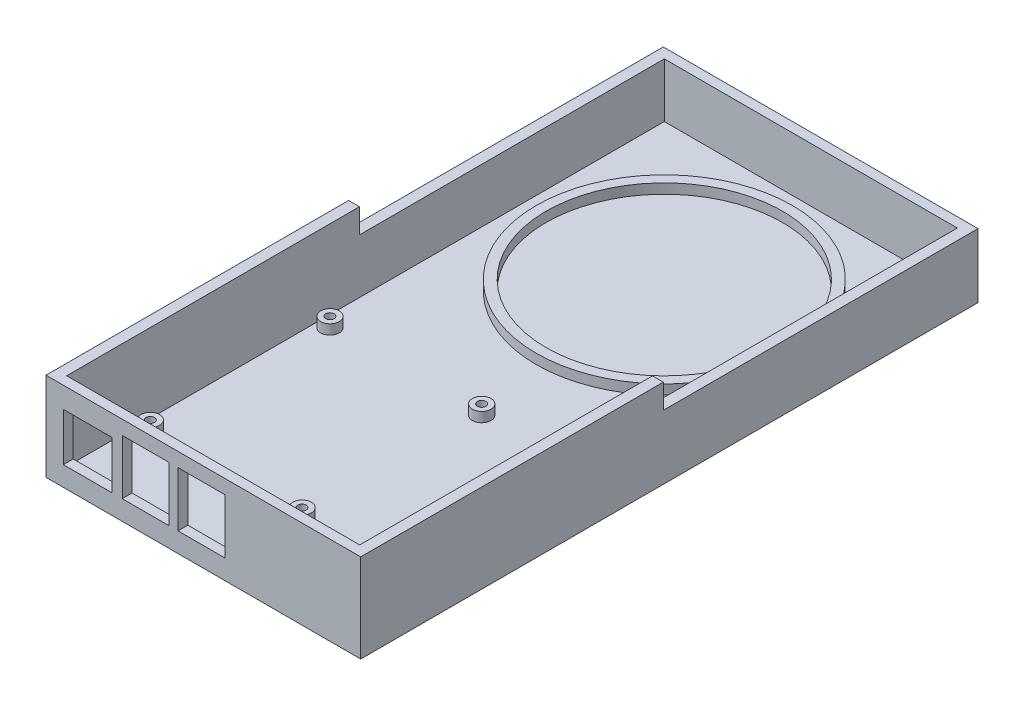
ISO-10303-21;
HEADER;
FILE_DESCRIPTION(('STEP AP214'),'2;1');
FILE_NAME('part.step','',(''),(''),'','','');
FILE_SCHEMA(('AUTOMOTIVE_DESIGN { 1 0 10303 214 1 1 1 1 }'));
ENDSEC;
DATA;
#1=APPLICATION_CONTEXT('core data for automotive mechanical design processes');
#2=APPLICATION_PROTOCOL_DEFINITION('international standard','automotive_design',2000,#1);
#3=PRODUCT_CONTEXT('',#1,'mechanical');
#4=PRODUCT('Part','Part','',(#3));
#5=PRODUCT_RELATED_PRODUCT_CATEGORY('part','',(#4));
#6=PRODUCT_DEFINITION_FORMATION('','',#4);
#7=PRODUCT_DEFINITION_CONTEXT('part definition',#1,'design');
#8=PRODUCT_DEFINITION('design','',#6,#7);
#9=PRODUCT_DEFINITION_SHAPE('','',#8);
#10=(LENGTH_UNIT() NAMED_UNIT(*) SI_UNIT(.MILLI.,.METRE.));
#11=(NAMED_UNIT(*) PLANE_ANGLE_UNIT() SI_UNIT($,.RADIAN.));
#12=(NAMED_UNIT(*) SI_UNIT($,.STERADIAN.) SOLID_ANGLE_UNIT());
#13=UNCERTAINTY_MEASURE_WITH_UNIT(LENGTH_MEASURE(1.E-05),#10,'distance_accuracy_value','');
#14=(GEOMETRIC_REPRESENTATION_CONTEXT(3) GLOBAL_UNCERTAINTY_ASSIGNED_CONTEXT((#13)) GLOBAL_UNIT_ASSIGNED_CONTEXT((#10,
#11,#12)) REPRESENTATION_CONTEXT('',''));
#15=CARTESIAN_POINT('',(0.,0.,0.));
#16=DIRECTION('',(0.,0.,1.));
#17=DIRECTION('',(1.,0.,0.));
#18=AXIS2_PLACEMENT_3D('',#15,#16,#17);
#19=CARTESIAN_POINT('',(0.,0.,0.));
#20=DIRECTION('',(0.,0.,-1.));
#21=DIRECTION('',(-1.,0.,0.));
#22=AXIS2_PLACEMENT_3D('',#19,#20,#21);
#23=PLANE('',#22);
#24=DIRECTION('',(0.,-1.,0.));
#25=VECTOR('',#24,1.);
#26=CARTESIAN_POINT('',(0.,0.,0.));
#27=LINE('',#26,#25);
#28=CARTESIAN_POINT('',(0.,20.701,0.));
#29=VERTEX_POINT('',#28);
#30=CARTESIAN_POINT('',(0.,0.,0.));
#31=VERTEX_POINT('',#30);
#32=EDGE_CURVE('E409',#29,#31,#27,.T.);
#33=ORIENTED_EDGE('',*,*,#32,.F.);
#34=DIRECTION('',(-1.,0.,0.));
#35=VECTOR('',#34,1.);
#36=CARTESIAN_POINT('',(0.,20.701,0.));
#37=LINE('',#36,#35);
#38=CARTESIAN_POINT('',(101.6,20.701,0.));
#39=VERTEX_POINT('',#38);
#40=EDGE_CURVE('E215',#39,#29,#37,.T.);
#41=ORIENTED_EDGE('',*,*,#40,.F.);
#42=DIRECTION('',(0.,1.,0.));
#43=VECTOR('',#42,1.);
#44=CARTESIAN_POINT('',(101.6,0.,0.));
#45=LINE('',#44,#43);
#46=CARTESIAN_POINT('',(101.6,0.,0.));
#47=VERTEX_POINT('',#46);
#48=EDGE_CURVE('E414',#47,#39,#45,.T.);
#49=ORIENTED_EDGE('',*,*,#48,.F.);
#50=DIRECTION('',(1.,0.,0.));
#51=VECTOR('',#50,1.);
#52=CARTESIAN_POINT('',(0.,0.,0.));
#53=LINE('',#52,#51);
#54=EDGE_CURVE('E420',#31,#47,#53,.T.);
#55=ORIENTED_EDGE('',*,*,#54,.F.);
#56=EDGE_LOOP('',(#33,#41,#49,#55));
#57=FACE_BOUND('',#56,.T.);
#58=ADVANCED_FACE('F41',(#57),#23,.T.);
#59=CARTESIAN_POINT('',(3.50000000000002,28.575,3.175));
#60=DIRECTION('',(0.,0.,1.));
#61=DIRECTION('',(1.,0.,0.));
#62=AXIS2_PLACEMENT_3D('',#59,#60,#61);
#63=PLANE('',#62);
#64=DIRECTION('',(0.,-1.,0.));
#65=VECTOR('',#64,1.);
#66=CARTESIAN_POINT('',(98.1,28.575,3.17499999999999));
#67=LINE('',#66,#65);
#68=CARTESIAN_POINT('',(98.1,20.701,3.17499999999999));
#69=VERTEX_POINT('',#68);
#70=CARTESIAN_POINT('',(98.1,3.175,3.17499999999999));
#71=VERTEX_POINT('',#70);
#72=EDGE_CURVE('E395',#69,#71,#67,.T.);
#73=ORIENTED_EDGE('',*,*,#72,.F.);
#74=DIRECTION('',(-1.,0.,0.));
#75=VECTOR('',#74,1.);
#76=CARTESIAN_POINT('',(3.50000000000002,20.701,3.175));
#77=LINE('',#76,#75);
#78=CARTESIAN_POINT('',(3.50000000000002,20.701,3.175));
#79=VERTEX_POINT('',#78);
#80=EDGE_CURVE('E49',#69,#79,#77,.T.);
#81=ORIENTED_EDGE('',*,*,#80,.T.);
#82=DIRECTION('',(0.,-1.,0.));
#83=VECTOR('',#82,1.);
#84=CARTESIAN_POINT('',(3.50000000000002,28.575,3.175));
#85=LINE('',#84,#83);
#86=CARTESIAN_POINT('',(3.50000000000002,3.175,3.17500000000001));
#87=VERTEX_POINT('',#86);
#88=EDGE_CURVE('E383',#79,#87,#85,.T.);
#89=ORIENTED_EDGE('',*,*,#88,.T.);
#90=DIRECTION('',(-1.,0.,0.));
#91=VECTOR('',#90,1.);
#92=CARTESIAN_POINT('',(3.50000000000002,3.175,3.175));
#93=LINE('',#92,#91);
#94=EDGE_CURVE('E378',#71,#87,#93,.T.);
#95=ORIENTED_EDGE('',*,*,#94,.F.);
#96=EDGE_LOOP('',(#73,#81,#89,#95));
#97=FACE_BOUND('',#96,.T.);
#98=ADVANCED_FACE('F446',(#97),#63,.T.);
#99=CARTESIAN_POINT('',(0.,0.,199.3));
#100=DIRECTION('',(1.,0.,0.));
#101=DIRECTION('',(0.,0.,-1.));
#102=AXIS2_PLACEMENT_3D('',#99,#100,#101);
#103=PLANE('',#102);
#104=DIRECTION('',(0.,0.,1.));
#105=VECTOR('',#104,1.);
#106=CARTESIAN_POINT('',(0.,28.575,0.));
#107=LINE('',#106,#105);
#108=CARTESIAN_POINT('',(0.,28.575,101.6));
#109=VERTEX_POINT('',#108);
#110=CARTESIAN_POINT('',(0.,28.575,199.3));
#111=VERTEX_POINT('',#110);
#112=EDGE_CURVE('E222',#109,#111,#107,.T.);
#113=ORIENTED_EDGE('',*,*,#112,.F.);
#114=DIRECTION('',(0.,1.,0.));
#115=VECTOR('',#114,1.);
#116=CARTESIAN_POINT('',(0.,20.701,101.6));
#117=LINE('',#116,#115);
#118=CARTESIAN_POINT('',(0.,20.701,101.6));
#119=VERTEX_POINT('',#118);
#120=EDGE_CURVE('E204',#119,#109,#117,.T.);
#121=ORIENTED_EDGE('',*,*,#120,.F.);
#122=DIRECTION('',(0.,0.,1.));
#123=VECTOR('',#122,1.);
#124=CARTESIAN_POINT('',(0.,20.701,0.));
#125=LINE('',#124,#123);
#126=EDGE_CURVE('E212',#29,#119,#125,.T.);
#127=ORIENTED_EDGE('',*,*,#126,.F.);
#128=ORIENTED_EDGE('',*,*,#32,.T.);
#129=DIRECTION('',(0.,0.,-1.));
#130=VECTOR('',#129,1.);
#131=CARTESIAN_POINT('',(0.,0.,199.3));
#132=LINE('',#131,#130);
#133=CARTESIAN_POINT('',(0.,0.,199.3));
#134=VERTEX_POINT('',#133);
#135=EDGE_CURVE('E426',#134,#31,#132,.T.);
#136=ORIENTED_EDGE('',*,*,#135,.F.);
#137=DIRECTION('',(0.,-1.,0.));
#138=VECTOR('',#137,1.);
#139=CARTESIAN_POINT('',(0.,0.,199.3));
#140=LINE('',#139,#138);
#141=EDGE_CURVE('E410',#111,#134,#140,.T.);
#142=ORIENTED_EDGE('',*,*,#141,.F.);
#143=EDGE_LOOP('',(#113,#121,#127,#128,#136,#142));
#144=FACE_BOUND('',#143,.T.);
#145=ADVANCED_FACE('F43',(#144),#103,.F.);
#146=CARTESIAN_POINT('',(0.,0.,199.3));
#147=DIRECTION('',(0.,1.,0.));
#148=DIRECTION('',(0.,0.,1.));
#149=AXIS2_PLACEMENT_3D('',#146,#147,#148);
#150=PLANE('',#149);
#151=CARTESIAN_POINT('',(7.127,0.,172.752));
#152=DIRECTION('',(0.,1.,0.));
#153=DIRECTION('',(0.,0.,1.));
#154=AXIS2_PLACEMENT_3D('',#151,#152,#153);
#155=CIRCLE('',#154,1.37499999999999);
#156=CARTESIAN_POINT('',(7.127,0.,174.127));
#157=VERTEX_POINT('',#156);
#158=EDGE_CURVE('E235',#157,#157,#155,.T.);
#159=ORIENTED_EDGE('',*,*,#158,.T.);
#160=EDGE_LOOP('',(#159));
#161=FACE_BOUND('',#160,.T.);
#162=CARTESIAN_POINT('',(56.127,0.,172.752));
#163=DIRECTION('',(0.,1.,0.));
#164=DIRECTION('',(0.,0.,1.));
#165=AXIS2_PLACEMENT_3D('',#162,#163,#164);
#166=CIRCLE('',#165,1.37500000000001);
#167=CARTESIAN_POINT('',(56.127,0.,174.127));
#168=VERTEX_POINT('',#167);
#169=EDGE_CURVE('E240',#168,#168,#166,.T.);
#170=ORIENTED_EDGE('',*,*,#169,.T.);
#171=EDGE_LOOP('',(#170));
#172=FACE_BOUND('',#171,.T.);
#173=CARTESIAN_POINT('',(56.127,0.,114.752));
#174=DIRECTION('',(0.,1.,0.));
#175=DIRECTION('',(0.,0.,1.));
#176=AXIS2_PLACEMENT_3D('',#173,#174,#175);
#177=CIRCLE('',#176,1.375);
#178=CARTESIAN_POINT('',(56.127,0.,116.127));
#179=VERTEX_POINT('',#178);
#180=EDGE_CURVE('E236',#179,#179,#177,.T.);
#181=ORIENTED_EDGE('',*,*,#180,.T.);
#182=EDGE_LOOP('',(#181));
#183=FACE_BOUND('',#182,.T.);
#184=CARTESIAN_POINT('',(7.12700000000002,0.,114.752));
#185=DIRECTION('',(0.,1.,0.));
#186=DIRECTION('',(0.,0.,1.));
#187=AXIS2_PLACEMENT_3D('',#184,#185,#186);
#188=CIRCLE('',#187,1.375);
#189=CARTESIAN_POINT('',(7.12700000000002,0.,116.127));
#190=VERTEX_POINT('',#189);
#191=EDGE_CURVE('E239',#190,#190,#188,.T.);
#192=ORIENTED_EDGE('',*,*,#191,.T.);
#193=EDGE_LOOP('',(#192));
#194=FACE_BOUND('',#193,.T.);
#195=ORIENTED_EDGE('',*,*,#54,.T.);
#196=DIRECTION('',(0.,0.,-1.));
#197=VECTOR('',#196,1.);
#198=CARTESIAN_POINT('',(101.6,0.,199.3));
#199=LINE('',#198,#197);
#200=CARTESIAN_POINT('',(101.6,0.,199.3));
#201=VERTEX_POINT('',#200);
#202=EDGE_CURVE('E418',#201,#47,#199,.T.);
#203=ORIENTED_EDGE('',*,*,#202,.F.);
#204=DIRECTION('',(1.,0.,0.));
#205=VECTOR('',#204,1.);
#206=CARTESIAN_POINT('',(0.,0.,199.3));
#207=LINE('',#206,#205);
#208=EDGE_CURVE('E413',#134,#201,#207,.T.);
#209=ORIENTED_EDGE('',*,*,#208,.F.);
#210=ORIENTED_EDGE('',*,*,#135,.T.);
#211=EDGE_LOOP('',(#195,#203,#209,#210));
#212=FACE_BOUND('',#211,.T.);
#213=ADVANCED_FACE('F483',(#161,#172,#183,#194,#212),#150,.F.);
#214=CARTESIAN_POINT('',(101.6,0.,199.3));
#215=DIRECTION('',(-1.,0.,0.));
#216=DIRECTION('',(0.,0.,1.));
#217=AXIS2_PLACEMENT_3D('',#214,#215,#216);
#218=PLANE('',#217);
#219=DIRECTION('',(0.,0.,-1.));
#220=VECTOR('',#219,1.);
#221=CARTESIAN_POINT('',(101.6,20.701,0.));
#222=LINE('',#221,#220);
#223=CARTESIAN_POINT('',(101.6,20.701,101.6));
#224=VERTEX_POINT('',#223);
#225=EDGE_CURVE('E208',#224,#39,#222,.T.);
#226=ORIENTED_EDGE('',*,*,#225,.F.);
#227=DIRECTION('',(0.,1.,0.));
#228=VECTOR('',#227,1.);
#229=CARTESIAN_POINT('',(101.6,20.701,101.6));
#230=LINE('',#229,#228);
#231=CARTESIAN_POINT('',(101.6,28.575,101.6));
#232=VERTEX_POINT('',#231);
#233=EDGE_CURVE('E223',#224,#232,#230,.T.);
#234=ORIENTED_EDGE('',*,*,#233,.T.);
#235=DIRECTION('',(0.,0.,-1.));
#236=VECTOR('',#235,1.);
#237=CARTESIAN_POINT('',(101.6,28.575,0.));
#238=LINE('',#237,#236);
#239=CARTESIAN_POINT('',(101.6,28.575,199.3));
#240=VERTEX_POINT('',#239);
#241=EDGE_CURVE('E406',#240,#232,#238,.T.);
#242=ORIENTED_EDGE('',*,*,#241,.F.);
#243=DIRECTION('',(0.,1.,0.));
#244=VECTOR('',#243,1.);
#245=CARTESIAN_POINT('',(101.6,0.,199.3));
#246=LINE('',#245,#244);
#247=EDGE_CURVE('E416',#201,#240,#246,.T.);
#248=ORIENTED_EDGE('',*,*,#247,.F.);
#249=ORIENTED_EDGE('',*,*,#202,.T.);
#250=ORIENTED_EDGE('',*,*,#48,.T.);
#251=EDGE_LOOP('',(#226,#234,#242,#248,#249,#250));
#252=FACE_BOUND('',#251,.T.);
#253=ADVANCED_FACE('F471',(#252),#218,.F.);
#254=CARTESIAN_POINT('',(0.,0.,199.3));
#255=DIRECTION('',(0.,0.,-1.));
#256=DIRECTION('',(-1.,0.,0.));
#257=AXIS2_PLACEMENT_3D('',#254,#255,#256);
#258=PLANE('',#257);
#259=DIRECTION('',(1.,0.,0.));
#260=VECTOR('',#259,1.);
#261=CARTESIAN_POINT('',(5.58275000000003,6.35,199.3));
#262=LINE('',#261,#260);
#263=CARTESIAN_POINT('',(5.58275000000003,6.35,199.3));
#264=VERTEX_POINT('',#263);
#265=CARTESIAN_POINT('',(21.26725,6.35,199.3));
#266=VERTEX_POINT('',#265);
#267=EDGE_CURVE('E263',#264,#266,#262,.T.);
#268=ORIENTED_EDGE('',*,*,#267,.F.);
#269=DIRECTION('',(0.,-1.,0.));
#270=VECTOR('',#269,1.);
#271=CARTESIAN_POINT('',(5.58275000000003,21.8186,199.3));
#272=LINE('',#271,#270);
#273=CARTESIAN_POINT('',(5.58275000000003,21.8186,199.3));
#274=VERTEX_POINT('',#273);
#275=EDGE_CURVE('E64',#274,#264,#272,.T.);
#276=ORIENTED_EDGE('',*,*,#275,.F.);
#277=DIRECTION('',(-1.,0.,0.));
#278=VECTOR('',#277,1.);
#279=CARTESIAN_POINT('',(5.58275000000003,21.8186,199.3));
#280=LINE('',#279,#278);
#281=CARTESIAN_POINT('',(21.26725,21.8186,199.3));
#282=VERTEX_POINT('',#281);
#283=EDGE_CURVE('E252',#282,#274,#280,.T.);
#284=ORIENTED_EDGE('',*,*,#283,.F.);
#285=DIRECTION('',(0.,1.,0.));
#286=VECTOR('',#285,1.);
#287=CARTESIAN_POINT('',(21.26725,21.8186,199.3));
#288=LINE('',#287,#286);
#289=EDGE_CURVE('E267',#266,#282,#288,.T.);
#290=ORIENTED_EDGE('',*,*,#289,.F.);
#291=EDGE_LOOP('',(#268,#276,#284,#290));
#292=FACE_BOUND('',#291,.T.);
#293=DIRECTION('',(1.,0.,0.));
#294=VECTOR('',#293,1.);
#295=CARTESIAN_POINT('',(24.6185,6.35,199.3));
#296=LINE('',#295,#294);
#297=CARTESIAN_POINT('',(24.6185,6.35,199.3));
#298=VERTEX_POINT('',#297);
#299=CARTESIAN_POINT('',(39.7315,6.35,199.3));
#300=VERTEX_POINT('',#299);
#301=EDGE_CURVE('E298',#298,#300,#296,.T.);
#302=ORIENTED_EDGE('',*,*,#301,.F.);
#303=DIRECTION('',(0.,-1.,0.));
#304=VECTOR('',#303,1.);
#305=CARTESIAN_POINT('',(24.6185,24.0411,199.3));
#306=LINE('',#305,#304);
#307=CARTESIAN_POINT('',(24.6185,24.0411,199.3));
#308=VERTEX_POINT('',#307);
#309=EDGE_CURVE('E264',#308,#298,#306,.T.);
#310=ORIENTED_EDGE('',*,*,#309,.F.);
#311=DIRECTION('',(-1.,0.,0.));
#312=VECTOR('',#311,1.);
#313=CARTESIAN_POINT('',(24.6185,24.0411,199.3));
#314=LINE('',#313,#312);
#315=CARTESIAN_POINT('',(39.7315,24.0411,199.3));
#316=VERTEX_POINT('',#315);
#317=EDGE_CURVE('E291',#316,#308,#314,.T.);
#318=ORIENTED_EDGE('',*,*,#317,.F.);
#319=DIRECTION('',(0.,1.,0.));
#320=VECTOR('',#319,1.);
#321=CARTESIAN_POINT('',(39.7315,24.0411,199.3));
#322=LINE('',#321,#320);
#323=EDGE_CURVE('E294',#300,#316,#322,.T.);
#324=ORIENTED_EDGE('',*,*,#323,.F.);
#325=EDGE_LOOP('',(#302,#310,#318,#324));
#326=FACE_BOUND('',#325,.T.);
#327=DIRECTION('',(1.,0.,0.));
#328=VECTOR('',#327,1.);
#329=CARTESIAN_POINT('',(42.6185,6.35,199.3));
#330=LINE('',#329,#328);
#331=CARTESIAN_POINT('',(42.6185,6.35,199.3));
#332=VERTEX_POINT('',#331);
#333=CARTESIAN_POINT('',(57.7315,6.35,199.3));
#334=VERTEX_POINT('',#333);
#335=EDGE_CURVE('E328',#332,#334,#330,.T.);
#336=ORIENTED_EDGE('',*,*,#335,.F.);
#337=DIRECTION('',(0.,-1.,0.));
#338=VECTOR('',#337,1.);
#339=CARTESIAN_POINT('',(42.6185,24.0411,199.3));
#340=LINE('',#339,#338);
#341=CARTESIAN_POINT('',(42.6185,24.0411,199.3));
#342=VERTEX_POINT('',#341);
#343=EDGE_CURVE('E290',#342,#332,#340,.T.);
#344=ORIENTED_EDGE('',*,*,#343,.F.);
#345=DIRECTION('',(-1.,0.,0.));
#346=VECTOR('',#345,1.);
#347=CARTESIAN_POINT('',(42.6185,24.0411,199.3));
#348=LINE('',#347,#346);
#349=CARTESIAN_POINT('',(57.7315,24.0411,199.3));
#350=VERTEX_POINT('',#349);
#351=EDGE_CURVE('E321',#350,#342,#348,.T.);
#352=ORIENTED_EDGE('',*,*,#351,.F.);
#353=DIRECTION('',(0.,1.,0.));
#354=VECTOR('',#353,1.);
#355=CARTESIAN_POINT('',(57.7315,24.0411,199.3));
#356=LINE('',#355,#354);
#357=EDGE_CURVE('E324',#334,#350,#356,.T.);
#358=ORIENTED_EDGE('',*,*,#357,.F.);
#359=EDGE_LOOP('',(#336,#344,#352,#358));
#360=FACE_BOUND('',#359,.T.);
#361=ORIENTED_EDGE('',*,*,#141,.T.);
#362=ORIENTED_EDGE('',*,*,#208,.T.);
#363=ORIENTED_EDGE('',*,*,#247,.T.);
#364=DIRECTION('',(1.,0.,0.));
#365=VECTOR('',#364,1.);
#366=CARTESIAN_POINT('',(0.,28.575,199.3));
#367=LINE('',#366,#365);
#368=EDGE_CURVE('E403',#111,#240,#367,.T.);
#369=ORIENTED_EDGE('',*,*,#368,.F.);
#370=EDGE_LOOP('',(#361,#362,#363,#369));
#371=FACE_BOUND('',#370,.T.);
#372=ADVANCED_FACE('F476',(#292,#326,#360,#371),#258,.F.);
#373=CARTESIAN_POINT('',(0.,28.575,0.));
#374=DIRECTION('',(0.,1.,0.));
#375=DIRECTION('',(0.,0.,1.));
#376=AXIS2_PLACEMENT_3D('',#373,#374,#375);
#377=PLANE('',#376);
#378=DIRECTION('',(1.,0.,0.));
#379=VECTOR('',#378,1.);
#380=CARTESIAN_POINT('',(0.,28.575,101.6));
#381=LINE('',#380,#379);
#382=CARTESIAN_POINT('',(3.50000000000002,28.575,101.6));
#383=VERTEX_POINT('',#382);
#384=EDGE_CURVE('E218',#109,#383,#381,.T.);
#385=ORIENTED_EDGE('',*,*,#384,.F.);
#386=ORIENTED_EDGE('',*,*,#112,.T.);
#387=ORIENTED_EDGE('',*,*,#368,.T.);
#388=ORIENTED_EDGE('',*,*,#241,.T.);
#389=CARTESIAN_POINT('',(98.1,28.575,101.6));
#390=VERTEX_POINT('',#389);
#391=EDGE_CURVE('E467',#390,#232,#381,.T.);
#392=ORIENTED_EDGE('',*,*,#391,.F.);
#393=DIRECTION('',(0.,0.,-1.));
#394=VECTOR('',#393,1.);
#395=CARTESIAN_POINT('',(98.1,28.575,3.17499999999999));
#396=LINE('',#395,#394);
#397=CARTESIAN_POINT('',(98.1,28.575,196.125));
#398=VERTEX_POINT('',#397);
#399=EDGE_CURVE('E380',#398,#390,#396,.T.);
#400=ORIENTED_EDGE('',*,*,#399,.F.);
#401=DIRECTION('',(1.,0.,0.));
#402=VECTOR('',#401,1.);
#403=CARTESIAN_POINT('',(3.50000000000004,28.575,196.125));
#404=LINE('',#403,#402);
#405=CARTESIAN_POINT('',(3.50000000000004,28.575,196.125));
#406=VERTEX_POINT('',#405);
#407=EDGE_CURVE('E377',#406,#398,#404,.T.);
#408=ORIENTED_EDGE('',*,*,#407,.F.);
#409=DIRECTION('',(0.,0.,1.));
#410=VECTOR('',#409,1.);
#411=CARTESIAN_POINT('',(3.50000000000002,28.575,3.175));
#412=LINE('',#411,#410);
#413=EDGE_CURVE('E375',#383,#406,#412,.T.);
#414=ORIENTED_EDGE('',*,*,#413,.F.);
#415=EDGE_LOOP('',(#385,#386,#387,#388,#392,#400,#408,#414));
#416=FACE_BOUND('',#415,.T.);
#417=ADVANCED_FACE('F473',(#416),#377,.T.);
#418=CARTESIAN_POINT('',(3.50000000000002,28.575,3.175));
#419=DIRECTION('',(1.,0.,0.));
#420=DIRECTION('',(0.,0.,-1.));
#421=AXIS2_PLACEMENT_3D('',#418,#419,#420);
#422=PLANE('',#421);
#423=DIRECTION('',(0.,-1.,0.));
#424=VECTOR('',#423,1.);
#425=CARTESIAN_POINT('',(3.50000000000003,28.575,101.6));
#426=LINE('',#425,#424);
#427=CARTESIAN_POINT('',(3.50000000000002,20.701,101.6));
#428=VERTEX_POINT('',#427);
#429=EDGE_CURVE('E207',#383,#428,#426,.T.);
#430=ORIENTED_EDGE('',*,*,#429,.F.);
#431=ORIENTED_EDGE('',*,*,#413,.T.);
#432=DIRECTION('',(0.,-1.,0.));
#433=VECTOR('',#432,1.);
#434=CARTESIAN_POINT('',(3.50000000000004,28.575,196.125));
#435=LINE('',#434,#433);
#436=CARTESIAN_POINT('',(3.50000000000004,3.175,196.125));
#437=VERTEX_POINT('',#436);
#438=EDGE_CURVE('E399',#406,#437,#435,.T.);
#439=ORIENTED_EDGE('',*,*,#438,.T.);
#440=DIRECTION('',(0.,0.,1.));
#441=VECTOR('',#440,1.);
#442=CARTESIAN_POINT('',(3.50000000000002,3.175,3.175));
#443=LINE('',#442,#441);
#444=EDGE_CURVE('E374',#87,#437,#443,.T.);
#445=ORIENTED_EDGE('',*,*,#444,.F.);
#446=ORIENTED_EDGE('',*,*,#88,.F.);
#447=DIRECTION('',(0.,0.,1.));
#448=VECTOR('',#447,1.);
#449=CARTESIAN_POINT('',(3.50000000000002,20.701,3.175));
#450=LINE('',#449,#448);
#451=EDGE_CURVE('E56',#79,#428,#450,.T.);
#452=ORIENTED_EDGE('',*,*,#451,.T.);
#453=EDGE_LOOP('',(#430,#431,#439,#445,#446,#452));
#454=FACE_BOUND('',#453,.T.);
#455=ADVANCED_FACE('F450',(#454),#422,.T.);
#456=CARTESIAN_POINT('',(3.50000000000004,28.575,196.125));
#457=DIRECTION('',(0.,0.,-1.));
#458=DIRECTION('',(-1.,0.,0.));
#459=AXIS2_PLACEMENT_3D('',#456,#457,#458);
#460=PLANE('',#459);
#461=DIRECTION('',(0.,-1.,0.));
#462=VECTOR('',#461,1.);
#463=CARTESIAN_POINT('',(5.58275000000003,21.8186,196.125));
#464=LINE('',#463,#462);
#465=CARTESIAN_POINT('',(5.58275000000003,21.8186,196.125));
#466=VERTEX_POINT('',#465);
#467=CARTESIAN_POINT('',(5.58275000000003,6.35,196.125));
#468=VERTEX_POINT('',#467);
#469=EDGE_CURVE('E248',#466,#468,#464,.T.);
#470=ORIENTED_EDGE('',*,*,#469,.T.);
#471=DIRECTION('',(1.,0.,0.));
#472=VECTOR('',#471,1.);
#473=CARTESIAN_POINT('',(5.58275000000003,6.35,196.125));
#474=LINE('',#473,#472);
#475=CARTESIAN_POINT('',(21.26725,6.34999999999999,196.125));
#476=VERTEX_POINT('',#475);
#477=EDGE_CURVE('E251',#468,#476,#474,.T.);
#478=ORIENTED_EDGE('',*,*,#477,.T.);
#479=DIRECTION('',(0.,1.,0.));
#480=VECTOR('',#479,1.);
#481=CARTESIAN_POINT('',(21.26725,21.8186,196.125));
#482=LINE('',#481,#480);
#483=CARTESIAN_POINT('',(21.26725,21.8186,196.125));
#484=VERTEX_POINT('',#483);
#485=EDGE_CURVE('E255',#476,#484,#482,.T.);
#486=ORIENTED_EDGE('',*,*,#485,.T.);
#487=DIRECTION('',(-1.,0.,0.));
#488=VECTOR('',#487,1.);
#489=CARTESIAN_POINT('',(5.58275000000003,21.8186,196.125));
#490=LINE('',#489,#488);
#491=EDGE_CURVE('E258',#484,#466,#490,.T.);
#492=ORIENTED_EDGE('',*,*,#491,.T.);
#493=EDGE_LOOP('',(#470,#478,#486,#492));
#494=FACE_BOUND('',#493,.T.);
#495=DIRECTION('',(0.,-1.,0.));
#496=VECTOR('',#495,1.);
#497=CARTESIAN_POINT('',(24.6185,24.0411,196.125));
#498=LINE('',#497,#496);
#499=CARTESIAN_POINT('',(24.6185,24.0411,196.125));
#500=VERTEX_POINT('',#499);
#501=CARTESIAN_POINT('',(24.6185,6.35,196.125));
#502=VERTEX_POINT('',#501);
#503=EDGE_CURVE('E295',#500,#502,#498,.T.);
#504=ORIENTED_EDGE('',*,*,#503,.T.);
#505=DIRECTION('',(1.,0.,0.));
#506=VECTOR('',#505,1.);
#507=CARTESIAN_POINT('',(24.6185,6.35,196.125));
#508=LINE('',#507,#506);
#509=CARTESIAN_POINT('',(39.7315,6.35,196.125));
#510=VERTEX_POINT('',#509);
#511=EDGE_CURVE('E307',#502,#510,#508,.T.);
#512=ORIENTED_EDGE('',*,*,#511,.T.);
#513=DIRECTION('',(0.,1.,0.));
#514=VECTOR('',#513,1.);
#515=CARTESIAN_POINT('',(39.7315,24.0411,196.125));
#516=LINE('',#515,#514);
#517=CARTESIAN_POINT('',(39.7315,24.0411,196.125));
#518=VERTEX_POINT('',#517);
#519=EDGE_CURVE('E304',#510,#518,#516,.T.);
#520=ORIENTED_EDGE('',*,*,#519,.T.);
#521=DIRECTION('',(-1.,0.,0.));
#522=VECTOR('',#521,1.);
#523=CARTESIAN_POINT('',(24.6185,24.0411,196.125));
#524=LINE('',#523,#522);
#525=EDGE_CURVE('E283',#518,#500,#524,.T.);
#526=ORIENTED_EDGE('',*,*,#525,.T.);
#527=EDGE_LOOP('',(#504,#512,#520,#526));
#528=FACE_BOUND('',#527,.T.);
#529=DIRECTION('',(0.,-1.,0.));
#530=VECTOR('',#529,1.);
#531=CARTESIAN_POINT('',(42.6185,24.0411,196.125));
#532=LINE('',#531,#530);
#533=CARTESIAN_POINT('',(42.6185,24.0411,196.125));
#534=VERTEX_POINT('',#533);
#535=CARTESIAN_POINT('',(42.6185,6.35,196.125));
#536=VERTEX_POINT('',#535);
#537=EDGE_CURVE('E325',#534,#536,#532,.T.);
#538=ORIENTED_EDGE('',*,*,#537,.T.);
#539=DIRECTION('',(1.,0.,0.));
#540=VECTOR('',#539,1.);
#541=CARTESIAN_POINT('',(42.6185,6.35,196.125));
#542=LINE('',#541,#540);
#543=CARTESIAN_POINT('',(57.7315,6.35,196.125));
#544=VERTEX_POINT('',#543);
#545=EDGE_CURVE('E337',#536,#544,#542,.T.);
#546=ORIENTED_EDGE('',*,*,#545,.T.);
#547=DIRECTION('',(0.,1.,0.));
#548=VECTOR('',#547,1.);
#549=CARTESIAN_POINT('',(57.7315,24.0411,196.125));
#550=LINE('',#549,#548);
#551=CARTESIAN_POINT('',(57.7315,24.0411,196.125));
#552=VERTEX_POINT('',#551);
#553=EDGE_CURVE('E334',#544,#552,#550,.T.);
#554=ORIENTED_EDGE('',*,*,#553,.T.);
#555=DIRECTION('',(-1.,0.,0.));
#556=VECTOR('',#555,1.);
#557=CARTESIAN_POINT('',(42.6185,24.0411,196.125));
#558=LINE('',#557,#556);
#559=EDGE_CURVE('E315',#552,#534,#558,.T.);
#560=ORIENTED_EDGE('',*,*,#559,.T.);
#561=EDGE_LOOP('',(#538,#546,#554,#560));
#562=FACE_BOUND('',#561,.T.);
#563=DIRECTION('',(1.,0.,0.));
#564=VECTOR('',#563,1.);
#565=CARTESIAN_POINT('',(3.50000000000004,3.175,196.125));
#566=LINE('',#565,#564);
#567=CARTESIAN_POINT('',(98.1,3.175,196.125));
#568=VERTEX_POINT('',#567);
#569=EDGE_CURVE('E386',#437,#568,#566,.T.);
#570=ORIENTED_EDGE('',*,*,#569,.F.);
#571=ORIENTED_EDGE('',*,*,#438,.F.);
#572=ORIENTED_EDGE('',*,*,#407,.T.);
#573=DIRECTION('',(0.,-1.,0.));
#574=VECTOR('',#573,1.);
#575=CARTESIAN_POINT('',(98.1,28.575,196.125));
#576=LINE('',#575,#574);
#577=EDGE_CURVE('E397',#398,#568,#576,.T.);
#578=ORIENTED_EDGE('',*,*,#577,.T.);
#579=EDGE_LOOP('',(#570,#571,#572,#578));
#580=FACE_BOUND('',#579,.T.);
#581=ADVANCED_FACE('F512',(#494,#528,#562,#580),#460,.T.);
#582=CARTESIAN_POINT('',(98.1,28.575,3.17499999999999));
#583=DIRECTION('',(-1.,0.,0.));
#584=DIRECTION('',(0.,0.,1.));
#585=AXIS2_PLACEMENT_3D('',#582,#583,#584);
#586=PLANE('',#585);
#587=DIRECTION('',(0.,1.,0.));
#588=VECTOR('',#587,1.);
#589=CARTESIAN_POINT('',(98.1,28.575,101.6));
#590=LINE('',#589,#588);
#591=CARTESIAN_POINT('',(98.1,20.701,101.6));
#592=VERTEX_POINT('',#591);
#593=EDGE_CURVE('E11',#592,#390,#590,.T.);
#594=ORIENTED_EDGE('',*,*,#593,.F.);
#595=DIRECTION('',(0.,0.,-1.));
#596=VECTOR('',#595,1.);
#597=CARTESIAN_POINT('',(98.1,20.701,3.17499999999999));
#598=LINE('',#597,#596);
#599=EDGE_CURVE('E226',#592,#69,#598,.T.);
#600=ORIENTED_EDGE('',*,*,#599,.T.);
#601=ORIENTED_EDGE('',*,*,#72,.T.);
#602=DIRECTION('',(0.,0.,-1.));
#603=VECTOR('',#602,1.);
#604=CARTESIAN_POINT('',(98.1,3.175,3.17499999999999));
#605=LINE('',#604,#603);
#606=EDGE_CURVE('E389',#568,#71,#605,.T.);
#607=ORIENTED_EDGE('',*,*,#606,.F.);
#608=ORIENTED_EDGE('',*,*,#577,.F.);
#609=ORIENTED_EDGE('',*,*,#399,.T.);
#610=EDGE_LOOP('',(#594,#600,#601,#607,#608,#609));
#611=FACE_BOUND('',#610,.T.);
#612=ADVANCED_FACE('F458',(#611),#586,.T.);
#613=CARTESIAN_POINT('',(0.,3.175,199.3));
#614=DIRECTION('',(0.,-1.,0.));
#615=DIRECTION('',(0.,0.,-1.));
#616=AXIS2_PLACEMENT_3D('',#613,#614,#615);
#617=PLANE('',#616);
#618=CARTESIAN_POINT('',(56.127,3.175,114.752));
#619=DIRECTION('',(0.,-1.,0.));
#620=DIRECTION('',(0.,0.,-1.));
#621=AXIS2_PLACEMENT_3D('',#618,#619,#620);
#622=CIRCLE('',#621,3.00000000000001);
#623=CARTESIAN_POINT('',(56.127,3.175,111.752));
#624=VERTEX_POINT('',#623);
#625=EDGE_CURVE('E441',#624,#624,#622,.F.);
#626=ORIENTED_EDGE('',*,*,#625,.F.);
#627=EDGE_LOOP('',(#626));
#628=FACE_BOUND('',#627,.T.);
#629=CARTESIAN_POINT('',(56.127,3.175,172.752));
#630=DIRECTION('',(0.,-1.,0.));
#631=DIRECTION('',(0.,0.,-1.));
#632=AXIS2_PLACEMENT_3D('',#629,#630,#631);
#633=CIRCLE('',#632,3.00000000000001);
#634=CARTESIAN_POINT('',(56.127,3.175,169.752));
#635=VERTEX_POINT('',#634);
#636=EDGE_CURVE('E438',#635,#635,#633,.F.);
#637=ORIENTED_EDGE('',*,*,#636,.F.);
#638=EDGE_LOOP('',(#637));
#639=FACE_BOUND('',#638,.T.);
#640=CARTESIAN_POINT('',(7.12700000000002,3.175,114.752));
#641=DIRECTION('',(0.,-1.,0.));
#642=DIRECTION('',(0.,0.,-1.));
#643=AXIS2_PLACEMENT_3D('',#640,#641,#642);
#644=CIRCLE('',#643,3.00000000000001);
#645=CARTESIAN_POINT('',(7.12700000000002,3.175,111.752));
#646=VERTEX_POINT('',#645);
#647=EDGE_CURVE('E435',#646,#646,#644,.F.);
#648=ORIENTED_EDGE('',*,*,#647,.F.);
#649=EDGE_LOOP('',(#648));
#650=FACE_BOUND('',#649,.T.);
#651=CARTESIAN_POINT('',(7.127,3.175,172.752));
#652=DIRECTION('',(0.,-1.,0.));
#653=DIRECTION('',(0.,0.,-1.));
#654=AXIS2_PLACEMENT_3D('',#651,#652,#653);
#655=CIRCLE('',#654,3.00000000000001);
#656=CARTESIAN_POINT('',(7.127,3.175,169.752));
#657=VERTEX_POINT('',#656);
#658=EDGE_CURVE('E432',#657,#657,#655,.F.);
#659=ORIENTED_EDGE('',*,*,#658,.F.);
#660=EDGE_LOOP('',(#659));
#661=FACE_BOUND('',#660,.T.);
#662=CARTESIAN_POINT('',(50.8,3.175,50.4750000000001));
#663=DIRECTION('',(0.,-1.,0.));
#664=DIRECTION('',(0.,0.,-1.));
#665=AXIS2_PLACEMENT_3D('',#662,#663,#664);
#666=CIRCLE('',#665,41.3385);
#667=CARTESIAN_POINT('',(50.8,3.175,9.13650000000013));
#668=VERTEX_POINT('',#667);
#669=EDGE_CURVE('E429',#668,#668,#666,.F.);
#670=ORIENTED_EDGE('',*,*,#669,.F.);
#671=EDGE_LOOP('',(#670));
#672=FACE_BOUND('',#671,.T.);
#673=ORIENTED_EDGE('',*,*,#94,.T.);
#674=ORIENTED_EDGE('',*,*,#444,.T.);
#675=ORIENTED_EDGE('',*,*,#569,.T.);
#676=ORIENTED_EDGE('',*,*,#606,.T.);
#677=EDGE_LOOP('',(#673,#674,#675,#676));
#678=FACE_BOUND('',#677,.T.);
#679=ADVANCED_FACE('F453',(#628,#639,#650,#661,#672,#678),#617,.F.);
#680=CARTESIAN_POINT('',(50.8,6.35,50.4750000000001));
#681=DIRECTION('',(0.,1.,0.));
#682=DIRECTION('',(0.,0.,1.));
#683=AXIS2_PLACEMENT_3D('',#680,#681,#682);
#684=PLANE('',#683);
#685=CARTESIAN_POINT('',(50.8,6.35,50.4750000000001));
#686=DIRECTION('',(0.,1.,0.));
#687=DIRECTION('',(0.,0.,1.));
#688=AXIS2_PLACEMENT_3D('',#685,#686,#687);
#689=CIRCLE('',#688,41.3385);
#690=CARTESIAN_POINT('',(50.8,6.35,91.8135000000001));
#691=VERTEX_POINT('',#690);
#692=EDGE_CURVE('E369',#691,#691,#689,.T.);
#693=ORIENTED_EDGE('',*,*,#692,.T.);
#694=EDGE_LOOP('',(#693));
#695=FACE_BOUND('',#694,.T.);
#696=CARTESIAN_POINT('',(50.8,6.35,50.4750000000001));
#697=DIRECTION('',(0.,1.,0.));
#698=DIRECTION('',(0.,0.,1.));
#699=AXIS2_PLACEMENT_3D('',#696,#697,#698);
#700=CIRCLE('',#699,38.1635);
#701=CARTESIAN_POINT('',(50.8,6.35,88.6385000000001));
#702=VERTEX_POINT('',#701);
#703=EDGE_CURVE('E366',#702,#702,#700,.T.);
#704=ORIENTED_EDGE('',*,*,#703,.F.);
#705=EDGE_LOOP('',(#704));
#706=FACE_BOUND('',#705,.T.);
#707=ADVANCED_FACE('F502',(#695,#706),#684,.T.);
#708=CARTESIAN_POINT('',(50.8,6.35,50.4750000000001));
#709=DIRECTION('',(0.,-1.,0.));
#710=DIRECTION('',(0.,0.,-1.));
#711=AXIS2_PLACEMENT_3D('',#708,#709,#710);
#712=CYLINDRICAL_SURFACE('',#711,41.3385);
#713=ORIENTED_EDGE('',*,*,#692,.F.);
#714=EDGE_LOOP('',(#713));
#715=FACE_BOUND('',#714,.T.);
#716=ORIENTED_EDGE('',*,*,#669,.T.);
#717=EDGE_LOOP('',(#716));
#718=FACE_BOUND('',#717,.T.);
#719=ADVANCED_FACE('F509',(#715,#718),#712,.T.);
#720=CARTESIAN_POINT('',(50.8,6.35,50.4750000000001));
#721=DIRECTION('',(0.,-1.,0.));
#722=DIRECTION('',(0.,0.,-1.));
#723=AXIS2_PLACEMENT_3D('',#720,#721,#722);
#724=CYLINDRICAL_SURFACE('',#723,38.1635);
#725=ORIENTED_EDGE('',*,*,#703,.T.);
#726=EDGE_LOOP('',(#725));
#727=FACE_BOUND('',#726,.T.);
#728=CARTESIAN_POINT('',(50.8,3.175,50.4750000000001));
#729=DIRECTION('',(0.,1.,0.));
#730=DIRECTION('',(0.,0.,1.));
#731=AXIS2_PLACEMENT_3D('',#728,#729,#730);
#732=CIRCLE('',#731,38.1635);
#733=CARTESIAN_POINT('',(50.8,3.175,88.6385000000001));
#734=VERTEX_POINT('',#733);
#735=EDGE_CURVE('E365',#734,#734,#732,.T.);
#736=ORIENTED_EDGE('',*,*,#735,.F.);
#737=EDGE_LOOP('',(#736));
#738=FACE_BOUND('',#737,.T.);
#739=ADVANCED_FACE('F518',(#727,#738),#724,.F.);
#740=ORIENTED_EDGE('',*,*,#735,.T.);
#741=EDGE_LOOP('',(#740));
#742=FACE_BOUND('',#741,.T.);
#743=ADVANCED_FACE('F504',(#742),#617,.F.);
#744=CARTESIAN_POINT('',(7.127,6.35,172.752));
#745=DIRECTION('',(0.,1.,0.));
#746=DIRECTION('',(0.,0.,1.));
#747=AXIS2_PLACEMENT_3D('',#744,#745,#746);
#748=PLANE('',#747);
#749=CARTESIAN_POINT('',(7.127,6.35,172.752));
#750=DIRECTION('',(0.,1.,0.));
#751=DIRECTION('',(0.,0.,1.));
#752=AXIS2_PLACEMENT_3D('',#749,#750,#751);
#753=CIRCLE('',#752,3.00000000000001);
#754=CARTESIAN_POINT('',(7.127,6.35,175.752));
#755=VERTEX_POINT('',#754);
#756=EDGE_CURVE('E362',#755,#755,#753,.T.);
#757=ORIENTED_EDGE('',*,*,#756,.T.);
#758=EDGE_LOOP('',(#757));
#759=FACE_BOUND('',#758,.T.);
#760=CARTESIAN_POINT('',(7.127,6.35,172.752));
#761=DIRECTION('',(0.,1.,0.));
#762=DIRECTION('',(0.,0.,1.));
#763=AXIS2_PLACEMENT_3D('',#760,#761,#762);
#764=CIRCLE('',#763,1.37499999999991);
#765=CARTESIAN_POINT('',(7.127,6.35,174.127));
#766=VERTEX_POINT('',#765);
#767=EDGE_CURVE('E359',#766,#766,#764,.T.);
#768=ORIENTED_EDGE('',*,*,#767,.F.);
#769=EDGE_LOOP('',(#768));
#770=FACE_BOUND('',#769,.T.);
#771=ADVANCED_FACE('F517',(#759,#770),#748,.T.);
#772=CARTESIAN_POINT('',(7.127,6.35,172.752));
#773=DIRECTION('',(0.,-1.,0.));
#774=DIRECTION('',(0.,0.,-1.));
#775=AXIS2_PLACEMENT_3D('',#772,#773,#774);
#776=CYLINDRICAL_SURFACE('',#775,3.00000000000001);
#777=ORIENTED_EDGE('',*,*,#756,.F.);
#778=EDGE_LOOP('',(#777));
#779=FACE_BOUND('',#778,.T.);
#780=ORIENTED_EDGE('',*,*,#658,.T.);
#781=EDGE_LOOP('',(#780));
#782=FACE_BOUND('',#781,.T.);
#783=ADVANCED_FACE('F524',(#779,#782),#776,.T.);
#784=CARTESIAN_POINT('',(7.127,6.35,172.752));
#785=DIRECTION('',(0.,-1.,0.));
#786=DIRECTION('',(0.,0.,-1.));
#787=AXIS2_PLACEMENT_3D('',#784,#785,#786);
#788=CYLINDRICAL_SURFACE('',#787,1.37499999999991);
#789=ORIENTED_EDGE('',*,*,#767,.T.);
#790=EDGE_LOOP('',(#789));
#791=FACE_BOUND('',#790,.T.);
#792=ORIENTED_EDGE('',*,*,#158,.F.);
#793=EDGE_LOOP('',(#792));
#794=FACE_BOUND('',#793,.T.);
#795=ADVANCED_FACE('F619',(#791,#794),#788,.F.);
#796=CARTESIAN_POINT('',(7.12700000000002,6.35,114.752));
#797=DIRECTION('',(0.,1.,0.));
#798=DIRECTION('',(0.,0.,1.));
#799=AXIS2_PLACEMENT_3D('',#796,#797,#798);
#800=PLANE('',#799);
#801=CARTESIAN_POINT('',(7.12700000000002,6.35,114.752));
#802=DIRECTION('',(0.,1.,0.));
#803=DIRECTION('',(0.,0.,1.));
#804=AXIS2_PLACEMENT_3D('',#801,#802,#803);
#805=CIRCLE('',#804,3.00000000000001);
#806=CARTESIAN_POINT('',(7.12700000000002,6.35,117.752));
#807=VERTEX_POINT('',#806);
#808=EDGE_CURVE('E353',#807,#807,#805,.T.);
#809=ORIENTED_EDGE('',*,*,#808,.T.);
#810=EDGE_LOOP('',(#809));
#811=FACE_BOUND('',#810,.T.);
#812=CARTESIAN_POINT('',(7.12700000000002,6.35,114.752));
#813=DIRECTION('',(0.,1.,0.));
#814=DIRECTION('',(0.,0.,1.));
#815=AXIS2_PLACEMENT_3D('',#812,#813,#814);
#816=CIRCLE('',#815,1.37499999999991);
#817=CARTESIAN_POINT('',(7.12700000000002,6.35,116.127));
#818=VERTEX_POINT('',#817);
#819=EDGE_CURVE('E356',#818,#818,#816,.T.);
#820=ORIENTED_EDGE('',*,*,#819,.F.);
#821=EDGE_LOOP('',(#820));
#822=FACE_BOUND('',#821,.T.);
#823=ADVANCED_FACE('F615',(#811,#822),#800,.T.);
#824=CARTESIAN_POINT('',(7.12700000000002,6.35,114.752));
#825=DIRECTION('',(0.,-1.,0.));
#826=DIRECTION('',(0.,0.,-1.));
#827=AXIS2_PLACEMENT_3D('',#824,#825,#826);
#828=CYLINDRICAL_SURFACE('',#827,3.00000000000001);
#829=ORIENTED_EDGE('',*,*,#808,.F.);
#830=EDGE_LOOP('',(#829));
#831=FACE_BOUND('',#830,.T.);
#832=ORIENTED_EDGE('',*,*,#647,.T.);
#833=EDGE_LOOP('',(#832));
#834=FACE_BOUND('',#833,.T.);
#835=ADVANCED_FACE('F612',(#831,#834),#828,.T.);
#836=CARTESIAN_POINT('',(7.12700000000002,6.35,114.752));
#837=DIRECTION('',(0.,-1.,0.));
#838=DIRECTION('',(0.,0.,-1.));
#839=AXIS2_PLACEMENT_3D('',#836,#837,#838);
#840=CYLINDRICAL_SURFACE('',#839,1.37499999999991);
#841=ORIENTED_EDGE('',*,*,#819,.T.);
#842=EDGE_LOOP('',(#841));
#843=FACE_BOUND('',#842,.T.);
#844=ORIENTED_EDGE('',*,*,#191,.F.);
#845=EDGE_LOOP('',(#844));
#846=FACE_BOUND('',#845,.T.);
#847=ADVANCED_FACE('F607',(#843,#846),#840,.F.);
#848=CARTESIAN_POINT('',(56.127,6.35,172.752));
#849=DIRECTION('',(0.,-1.,0.));
#850=DIRECTION('',(0.,0.,-1.));
#851=AXIS2_PLACEMENT_3D('',#848,#849,#850);
#852=PLANE('',#851);
#853=CARTESIAN_POINT('',(56.127,6.35,172.752));
#854=DIRECTION('',(0.,1.,0.));
#855=DIRECTION('',(0.,0.,-1.));
#856=AXIS2_PLACEMENT_3D('',#853,#854,#855);
#857=CIRCLE('',#856,3.00000000000001);
#858=CARTESIAN_POINT('',(56.127,6.35,169.752));
#859=VERTEX_POINT('',#858);
#860=EDGE_CURVE('E347',#859,#859,#857,.T.);
#861=ORIENTED_EDGE('',*,*,#860,.T.);
#862=EDGE_LOOP('',(#861));
#863=FACE_BOUND('',#862,.T.);
#864=CARTESIAN_POINT('',(56.127,6.35,172.752));
#865=DIRECTION('',(0.,1.,0.));
#866=DIRECTION('',(0.,0.,-1.));
#867=AXIS2_PLACEMENT_3D('',#864,#865,#866);
#868=CIRCLE('',#867,1.3749999999999);
#869=CARTESIAN_POINT('',(56.127,6.35,171.377));
#870=VERTEX_POINT('',#869);
#871=EDGE_CURVE('E350',#870,#870,#868,.T.);
#872=ORIENTED_EDGE('',*,*,#871,.F.);
#873=EDGE_LOOP('',(#872));
#874=FACE_BOUND('',#873,.T.);
#875=ADVANCED_FACE('F603',(#863,#874),#852,.F.);
#876=CARTESIAN_POINT('',(56.127,6.35,172.752));
#877=DIRECTION('',(0.,-1.,0.));
#878=DIRECTION('',(0.,0.,-1.));
#879=AXIS2_PLACEMENT_3D('',#876,#877,#878);
#880=CYLINDRICAL_SURFACE('',#879,3.00000000000001);
#881=ORIENTED_EDGE('',*,*,#860,.F.);
#882=EDGE_LOOP('',(#881));
#883=FACE_BOUND('',#882,.T.);
#884=ORIENTED_EDGE('',*,*,#636,.T.);
#885=EDGE_LOOP('',(#884));
#886=FACE_BOUND('',#885,.T.);
#887=ADVANCED_FACE('F600',(#883,#886),#880,.T.);
#888=CARTESIAN_POINT('',(56.127,6.35,172.752));
#889=DIRECTION('',(0.,-1.,0.));
#890=DIRECTION('',(0.,0.,-1.));
#891=AXIS2_PLACEMENT_3D('',#888,#889,#890);
#892=CYLINDRICAL_SURFACE('',#891,1.3749999999999);
#893=ORIENTED_EDGE('',*,*,#871,.T.);
#894=EDGE_LOOP('',(#893));
#895=FACE_BOUND('',#894,.T.);
#896=ORIENTED_EDGE('',*,*,#169,.F.);
#897=EDGE_LOOP('',(#896));
#898=FACE_BOUND('',#897,.T.);
#899=ADVANCED_FACE('F595',(#895,#898),#892,.F.);
#900=CARTESIAN_POINT('',(56.127,6.35,114.752));
#901=DIRECTION('',(0.,-1.,0.));
#902=DIRECTION('',(0.,0.,-1.));
#903=AXIS2_PLACEMENT_3D('',#900,#901,#902);
#904=PLANE('',#903);
#905=CARTESIAN_POINT('',(56.127,6.35,114.752));
#906=DIRECTION('',(0.,1.,0.));
#907=DIRECTION('',(0.,0.,-1.));
#908=AXIS2_PLACEMENT_3D('',#905,#906,#907);
#909=CIRCLE('',#908,3.00000000000001);
#910=CARTESIAN_POINT('',(56.127,6.35,111.752));
#911=VERTEX_POINT('',#910);
#912=EDGE_CURVE('E274',#911,#911,#909,.T.);
#913=ORIENTED_EDGE('',*,*,#912,.T.);
#914=EDGE_LOOP('',(#913));
#915=FACE_BOUND('',#914,.T.);
#916=CARTESIAN_POINT('',(56.127,6.35,114.752));
#917=DIRECTION('',(0.,1.,0.));
#918=DIRECTION('',(0.,0.,-1.));
#919=AXIS2_PLACEMENT_3D('',#916,#917,#918);
#920=CIRCLE('',#919,1.37499999999991);
#921=CARTESIAN_POINT('',(56.127,6.35,113.377));
#922=VERTEX_POINT('',#921);
#923=EDGE_CURVE('E344',#922,#922,#920,.T.);
#924=ORIENTED_EDGE('',*,*,#923,.F.);
#925=EDGE_LOOP('',(#924));
#926=FACE_BOUND('',#925,.T.);
#927=ADVANCED_FACE('F591',(#915,#926),#904,.F.);
#928=CARTESIAN_POINT('',(56.127,6.35,114.752));
#929=DIRECTION('',(0.,-1.,0.));
#930=DIRECTION('',(0.,0.,-1.));
#931=AXIS2_PLACEMENT_3D('',#928,#929,#930);
#932=CYLINDRICAL_SURFACE('',#931,3.00000000000001);
#933=ORIENTED_EDGE('',*,*,#912,.F.);
#934=EDGE_LOOP('',(#933));
#935=FACE_BOUND('',#934,.T.);
#936=ORIENTED_EDGE('',*,*,#625,.T.);
#937=EDGE_LOOP('',(#936));
#938=FACE_BOUND('',#937,.T.);
#939=ADVANCED_FACE('F587',(#935,#938),#932,.T.);
#940=CARTESIAN_POINT('',(56.127,6.35,114.752));
#941=DIRECTION('',(0.,-1.,0.));
#942=DIRECTION('',(0.,0.,-1.));
#943=AXIS2_PLACEMENT_3D('',#940,#941,#942);
#944=CYLINDRICAL_SURFACE('',#943,1.37499999999991);
#945=ORIENTED_EDGE('',*,*,#923,.T.);
#946=EDGE_LOOP('',(#945));
#947=FACE_BOUND('',#946,.T.);
#948=ORIENTED_EDGE('',*,*,#180,.F.);
#949=EDGE_LOOP('',(#948));
#950=FACE_BOUND('',#949,.T.);
#951=ADVANCED_FACE('F590',(#947,#950),#944,.F.);
#952=CARTESIAN_POINT('',(42.6185,24.0411,196.125));
#953=DIRECTION('',(-1.,0.,0.));
#954=DIRECTION('',(0.,-1.,0.));
#955=AXIS2_PLACEMENT_3D('',#952,#953,#954);
#956=PLANE('',#955);
#957=ORIENTED_EDGE('',*,*,#343,.T.);
#958=DIRECTION('',(0.,0.,1.));
#959=VECTOR('',#958,1.);
#960=CARTESIAN_POINT('',(42.6185,6.35,196.125));
#961=LINE('',#960,#959);
#962=EDGE_CURVE('E312',#536,#332,#961,.T.);
#963=ORIENTED_EDGE('',*,*,#962,.F.);
#964=ORIENTED_EDGE('',*,*,#537,.F.);
#965=DIRECTION('',(0.,0.,1.));
#966=VECTOR('',#965,1.);
#967=CARTESIAN_POINT('',(42.6185,24.0411,196.125));
#968=LINE('',#967,#966);
#969=EDGE_CURVE('E247',#534,#342,#968,.T.);
#970=ORIENTED_EDGE('',*,*,#969,.T.);
#971=EDGE_LOOP('',(#957,#963,#964,#970));
#972=FACE_BOUND('',#971,.T.);
#973=ADVANCED_FACE('F566',(#972),#956,.F.);
#974=CARTESIAN_POINT('',(42.6185,24.0411,196.125));
#975=DIRECTION('',(0.,1.,0.));
#976=DIRECTION('',(0.,0.,1.));
#977=AXIS2_PLACEMENT_3D('',#974,#975,#976);
#978=PLANE('',#977);
#979=ORIENTED_EDGE('',*,*,#351,.T.);
#980=ORIENTED_EDGE('',*,*,#969,.F.);
#981=ORIENTED_EDGE('',*,*,#559,.F.);
#982=DIRECTION('',(0.,0.,1.));
#983=VECTOR('',#982,1.);
#984=CARTESIAN_POINT('',(57.7315,24.0411,196.125));
#985=LINE('',#984,#983);
#986=EDGE_CURVE('E318',#552,#350,#985,.T.);
#987=ORIENTED_EDGE('',*,*,#986,.T.);
#988=EDGE_LOOP('',(#979,#980,#981,#987));
#989=FACE_BOUND('',#988,.T.);
#990=ADVANCED_FACE('F569',(#989),#978,.F.);
#991=CARTESIAN_POINT('',(57.7315,24.0411,196.125));
#992=DIRECTION('',(1.,0.,0.));
#993=DIRECTION('',(0.,1.,0.));
#994=AXIS2_PLACEMENT_3D('',#991,#992,#993);
#995=PLANE('',#994);
#996=ORIENTED_EDGE('',*,*,#357,.T.);
#997=ORIENTED_EDGE('',*,*,#986,.F.);
#998=ORIENTED_EDGE('',*,*,#553,.F.);
#999=DIRECTION('',(0.,0.,1.));
#1000=VECTOR('',#999,1.);
#1001=CARTESIAN_POINT('',(57.7315,6.35,196.125));
#1002=LINE('',#1001,#1000);
#1003=EDGE_CURVE('E316',#544,#334,#1002,.T.);
#1004=ORIENTED_EDGE('',*,*,#1003,.T.);
#1005=EDGE_LOOP('',(#996,#997,#998,#1004));
#1006=FACE_BOUND('',#1005,.T.);
#1007=ADVANCED_FACE('F571',(#1006),#995,.F.);
#1008=CARTESIAN_POINT('',(42.6185,6.35,196.125));
#1009=DIRECTION('',(0.,-1.,0.));
#1010=DIRECTION('',(0.,0.,-1.));
#1011=AXIS2_PLACEMENT_3D('',#1008,#1009,#1010);
#1012=PLANE('',#1011);
#1013=ORIENTED_EDGE('',*,*,#335,.T.);
#1014=ORIENTED_EDGE('',*,*,#1003,.F.);
#1015=ORIENTED_EDGE('',*,*,#545,.F.);
#1016=ORIENTED_EDGE('',*,*,#962,.T.);
#1017=EDGE_LOOP('',(#1013,#1014,#1015,#1016));
#1018=FACE_BOUND('',#1017,.T.);
#1019=ADVANCED_FACE('F562',(#1018),#1012,.F.);
#1020=CARTESIAN_POINT('',(24.6185,24.0411,196.125));
#1021=DIRECTION('',(-1.,0.,0.));
#1022=DIRECTION('',(0.,-1.,0.));
#1023=AXIS2_PLACEMENT_3D('',#1020,#1021,#1022);
#1024=PLANE('',#1023);
#1025=ORIENTED_EDGE('',*,*,#309,.T.);
#1026=DIRECTION('',(0.,0.,1.));
#1027=VECTOR('',#1026,1.);
#1028=CARTESIAN_POINT('',(24.6185,6.35,196.125));
#1029=LINE('',#1028,#1027);
#1030=EDGE_CURVE('E280',#502,#298,#1029,.T.);
#1031=ORIENTED_EDGE('',*,*,#1030,.F.);
#1032=ORIENTED_EDGE('',*,*,#503,.F.);
#1033=DIRECTION('',(0.,0.,1.));
#1034=VECTOR('',#1033,1.);
#1035=CARTESIAN_POINT('',(24.6185,24.0411,196.125));
#1036=LINE('',#1035,#1034);
#1037=EDGE_CURVE('E288',#500,#308,#1036,.T.);
#1038=ORIENTED_EDGE('',*,*,#1037,.T.);
#1039=EDGE_LOOP('',(#1025,#1031,#1032,#1038));
#1040=FACE_BOUND('',#1039,.T.);
#1041=ADVANCED_FACE('F582',(#1040),#1024,.F.);
#1042=CARTESIAN_POINT('',(24.6185,24.0411,196.125));
#1043=DIRECTION('',(0.,1.,0.));
#1044=DIRECTION('',(-1.,0.,0.));
#1045=AXIS2_PLACEMENT_3D('',#1042,#1043,#1044);
#1046=PLANE('',#1045);
#1047=ORIENTED_EDGE('',*,*,#317,.T.);
#1048=ORIENTED_EDGE('',*,*,#1037,.F.);
#1049=ORIENTED_EDGE('',*,*,#525,.F.);
#1050=DIRECTION('',(0.,0.,1.));
#1051=VECTOR('',#1050,1.);
#1052=CARTESIAN_POINT('',(39.7315,24.0411,196.125));
#1053=LINE('',#1052,#1051);
#1054=EDGE_CURVE('E286',#518,#316,#1053,.T.);
#1055=ORIENTED_EDGE('',*,*,#1054,.T.);
#1056=EDGE_LOOP('',(#1047,#1048,#1049,#1055));
#1057=FACE_BOUND('',#1056,.T.);
#1058=ADVANCED_FACE('F822',(#1057),#1046,.F.);
#1059=CARTESIAN_POINT('',(39.7315,24.0411,196.125));
#1060=DIRECTION('',(1.,0.,0.));
#1061=DIRECTION('',(0.,0.,-1.));
#1062=AXIS2_PLACEMENT_3D('',#1059,#1060,#1061);
#1063=PLANE('',#1062);
#1064=ORIENTED_EDGE('',*,*,#323,.T.);
#1065=ORIENTED_EDGE('',*,*,#1054,.F.);
#1066=ORIENTED_EDGE('',*,*,#519,.F.);
#1067=DIRECTION('',(0.,0.,1.));
#1068=VECTOR('',#1067,1.);
#1069=CARTESIAN_POINT('',(39.7315,6.35,196.125));
#1070=LINE('',#1069,#1068);
#1071=EDGE_CURVE('E284',#510,#300,#1070,.T.);
#1072=ORIENTED_EDGE('',*,*,#1071,.T.);
#1073=EDGE_LOOP('',(#1064,#1065,#1066,#1072));
#1074=FACE_BOUND('',#1073,.T.);
#1075=ADVANCED_FACE('F832',(#1074),#1063,.F.);
#1076=CARTESIAN_POINT('',(24.6185,6.35,196.125));
#1077=DIRECTION('',(0.,-1.,0.));
#1078=DIRECTION('',(1.,0.,0.));
#1079=AXIS2_PLACEMENT_3D('',#1076,#1077,#1078);
#1080=PLANE('',#1079);
#1081=ORIENTED_EDGE('',*,*,#301,.T.);
#1082=ORIENTED_EDGE('',*,*,#1071,.F.);
#1083=ORIENTED_EDGE('',*,*,#511,.F.);
#1084=ORIENTED_EDGE('',*,*,#1030,.T.);
#1085=EDGE_LOOP('',(#1081,#1082,#1083,#1084));
#1086=FACE_BOUND('',#1085,.T.);
#1087=ADVANCED_FACE('F842',(#1086),#1080,.F.);
#1088=CARTESIAN_POINT('',(5.58275000000003,21.8186,196.125));
#1089=DIRECTION('',(-1.,0.,0.));
#1090=DIRECTION('',(0.,-1.,0.));
#1091=AXIS2_PLACEMENT_3D('',#1088,#1089,#1090);
#1092=PLANE('',#1091);
#1093=ORIENTED_EDGE('',*,*,#275,.T.);
#1094=DIRECTION('',(0.,0.,1.));
#1095=VECTOR('',#1094,1.);
#1096=CARTESIAN_POINT('',(5.58275000000003,6.35,196.125));
#1097=LINE('',#1096,#1095);
#1098=EDGE_CURVE('E261',#468,#264,#1097,.T.);
#1099=ORIENTED_EDGE('',*,*,#1098,.F.);
#1100=ORIENTED_EDGE('',*,*,#469,.F.);
#1101=DIRECTION('',(0.,0.,1.));
#1102=VECTOR('',#1101,1.);
#1103=CARTESIAN_POINT('',(5.58275000000003,21.8186,196.125));
#1104=LINE('',#1103,#1102);
#1105=EDGE_CURVE('E272',#466,#274,#1104,.T.);
#1106=ORIENTED_EDGE('',*,*,#1105,.T.);
#1107=EDGE_LOOP('',(#1093,#1099,#1100,#1106));
#1108=FACE_BOUND('',#1107,.T.);
#1109=ADVANCED_FACE('F852',(#1108),#1092,.F.);
#1110=CARTESIAN_POINT('',(5.58275000000003,21.8186,196.125));
#1111=DIRECTION('',(0.,1.,0.));
#1112=DIRECTION('',(-1.,0.,0.));
#1113=AXIS2_PLACEMENT_3D('',#1110,#1111,#1112);
#1114=PLANE('',#1113);
#1115=ORIENTED_EDGE('',*,*,#283,.T.);
#1116=ORIENTED_EDGE('',*,*,#1105,.F.);
#1117=ORIENTED_EDGE('',*,*,#491,.F.);
#1118=DIRECTION('',(0.,0.,1.));
#1119=VECTOR('',#1118,1.);
#1120=CARTESIAN_POINT('',(21.26725,21.8186,196.125));
#1121=LINE('',#1120,#1119);
#1122=EDGE_CURVE('E275',#484,#282,#1121,.T.);
#1123=ORIENTED_EDGE('',*,*,#1122,.T.);
#1124=EDGE_LOOP('',(#1115,#1116,#1117,#1123));
#1125=FACE_BOUND('',#1124,.T.);
#1126=ADVANCED_FACE('F862',(#1125),#1114,.F.);
#1127=CARTESIAN_POINT('',(21.26725,21.8186,196.125));
#1128=DIRECTION('',(1.,0.,0.));
#1129=DIRECTION('',(0.,1.,0.));
#1130=AXIS2_PLACEMENT_3D('',#1127,#1128,#1129);
#1131=PLANE('',#1130);
#1132=ORIENTED_EDGE('',*,*,#289,.T.);
#1133=ORIENTED_EDGE('',*,*,#1122,.F.);
#1134=ORIENTED_EDGE('',*,*,#485,.F.);
#1135=DIRECTION('',(0.,0.,1.));
#1136=VECTOR('',#1135,1.);
#1137=CARTESIAN_POINT('',(21.26725,6.35,196.125));
#1138=LINE('',#1137,#1136);
#1139=EDGE_CURVE('E277',#476,#266,#1138,.T.);
#1140=ORIENTED_EDGE('',*,*,#1139,.T.);
#1141=EDGE_LOOP('',(#1132,#1133,#1134,#1140));
#1142=FACE_BOUND('',#1141,.T.);
#1143=ADVANCED_FACE('F871',(#1142),#1131,.F.);
#1144=CARTESIAN_POINT('',(5.58275000000003,6.35,196.125));
#1145=DIRECTION('',(0.,-1.,0.));
#1146=DIRECTION('',(1.,0.,0.));
#1147=AXIS2_PLACEMENT_3D('',#1144,#1145,#1146);
#1148=PLANE('',#1147);
#1149=ORIENTED_EDGE('',*,*,#267,.T.);
#1150=ORIENTED_EDGE('',*,*,#1139,.F.);
#1151=ORIENTED_EDGE('',*,*,#477,.F.);
#1152=ORIENTED_EDGE('',*,*,#1098,.T.);
#1153=EDGE_LOOP('',(#1149,#1150,#1151,#1152));
#1154=FACE_BOUND('',#1153,.T.);
#1155=ADVANCED_FACE('F881',(#1154),#1148,.F.);
#1156=CARTESIAN_POINT('',(0.,20.701,101.6));
#1157=DIRECTION('',(0.,0.,1.));
#1158=DIRECTION('',(1.,0.,0.));
#1159=AXIS2_PLACEMENT_3D('',#1156,#1157,#1158);
#1160=PLANE('',#1159);
#1161=ORIENTED_EDGE('',*,*,#429,.T.);
#1162=DIRECTION('',(1.,0.,0.));
#1163=VECTOR('',#1162,1.);
#1164=CARTESIAN_POINT('',(0.,20.701,101.6));
#1165=LINE('',#1164,#1163);
#1166=EDGE_CURVE('E200',#119,#428,#1165,.T.);
#1167=ORIENTED_EDGE('',*,*,#1166,.F.);
#1168=ORIENTED_EDGE('',*,*,#120,.T.);
#1169=ORIENTED_EDGE('',*,*,#384,.T.);
#1170=EDGE_LOOP('',(#1161,#1167,#1168,#1169));
#1171=FACE_BOUND('',#1170,.T.);
#1172=ADVANCED_FACE('F202',(#1171),#1160,.F.);
#1173=ORIENTED_EDGE('',*,*,#593,.T.);
#1174=ORIENTED_EDGE('',*,*,#391,.T.);
#1175=ORIENTED_EDGE('',*,*,#233,.F.);
#1176=EDGE_CURVE('E209',#592,#224,#1165,.T.);
#1177=ORIENTED_EDGE('',*,*,#1176,.F.);
#1178=EDGE_LOOP('',(#1173,#1174,#1175,#1177));
#1179=FACE_BOUND('',#1178,.T.);
#1180=ADVANCED_FACE('F463',(#1179),#1160,.F.);
#1181=CARTESIAN_POINT('',(0.,20.701,0.));
#1182=DIRECTION('',(0.,1.,0.));
#1183=DIRECTION('',(0.,0.,1.));
#1184=AXIS2_PLACEMENT_3D('',#1181,#1182,#1183);
#1185=PLANE('',#1184);
#1186=ORIENTED_EDGE('',*,*,#80,.F.);
#1187=ORIENTED_EDGE('',*,*,#599,.F.);
#1188=ORIENTED_EDGE('',*,*,#1176,.T.);
#1189=ORIENTED_EDGE('',*,*,#225,.T.);
#1190=ORIENTED_EDGE('',*,*,#40,.T.);
#1191=ORIENTED_EDGE('',*,*,#126,.T.);
#1192=ORIENTED_EDGE('',*,*,#1166,.T.);
#1193=ORIENTED_EDGE('',*,*,#451,.F.);
#1194=EDGE_LOOP('',(#1186,#1187,#1188,#1189,#1190,#1191,#1192,#1193));
#1195=FACE_BOUND('',#1194,.T.);
#1196=ADVANCED_FACE('F213',(#1195),#1185,.T.);
#1197=CLOSED_SHELL('',(#58,#98,#145,#213,#253,#372,#417,#455,#581,#612,#679,#707,#719,#739,#743,
#771,#783,#795,#823,#835,#847,#875,#887,#899,#927,#939,#951,#973,#990,#1007,#1019,#1041,#1058,
#1075,#1087,#1109,#1126,#1143,#1155,#1172,#1180,#1196));
#1198=MANIFOLD_SOLID_BREP('B2',#1197);
#1199=ADVANCED_BREP_SHAPE_REPRESENTATION('',(#18,#1198),#14);
#1200=SHAPE_DEFINITION_REPRESENTATION(#9,#1199);
ENDSEC;
END-ISO-10303-21;
